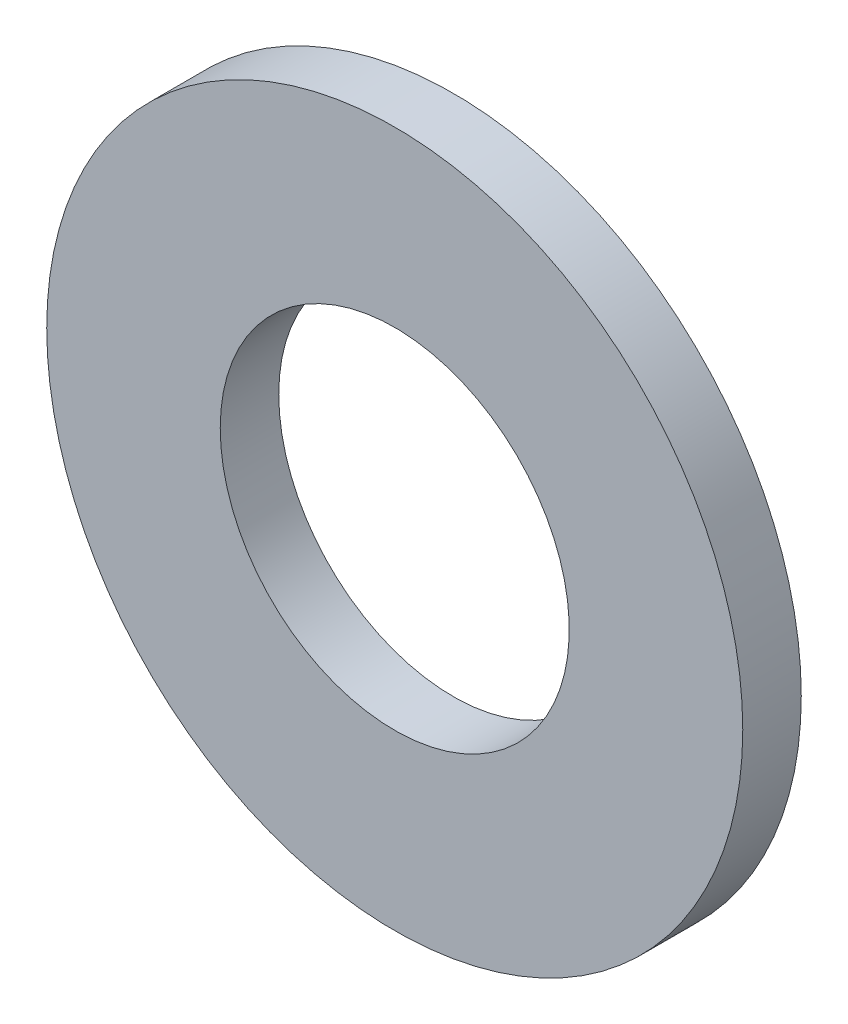
ISO-10303-21;
HEADER;
FILE_DESCRIPTION(('STEP AP214'),'2;1');
FILE_NAME('part.step','',(''),(''),'','','');
FILE_SCHEMA(('AUTOMOTIVE_DESIGN { 1 0 10303 214 1 1 1 1 }'));
ENDSEC;
DATA;
#1=APPLICATION_CONTEXT('core data for automotive mechanical design processes');
#2=APPLICATION_PROTOCOL_DEFINITION('international standard','automotive_design',2000,#1);
#3=PRODUCT_CONTEXT('',#1,'mechanical');
#4=PRODUCT('Part','Part','',(#3));
#5=PRODUCT_RELATED_PRODUCT_CATEGORY('part','',(#4));
#6=PRODUCT_DEFINITION_FORMATION('','',#4);
#7=PRODUCT_DEFINITION_CONTEXT('part definition',#1,'design');
#8=PRODUCT_DEFINITION('design','',#6,#7);
#9=PRODUCT_DEFINITION_SHAPE('','',#8);
#10=(LENGTH_UNIT() NAMED_UNIT(*) SI_UNIT(.MILLI.,.METRE.));
#11=(NAMED_UNIT(*) PLANE_ANGLE_UNIT() SI_UNIT($,.RADIAN.));
#12=(NAMED_UNIT(*) SI_UNIT($,.STERADIAN.) SOLID_ANGLE_UNIT());
#13=UNCERTAINTY_MEASURE_WITH_UNIT(LENGTH_MEASURE(1.E-05),#10,'distance_accuracy_value','');
#14=(GEOMETRIC_REPRESENTATION_CONTEXT(3) GLOBAL_UNCERTAINTY_ASSIGNED_CONTEXT((#13)) GLOBAL_UNIT_ASSIGNED_CONTEXT((#10,
#11,#12)) REPRESENTATION_CONTEXT('',''));
#15=CARTESIAN_POINT('',(0.,0.,0.));
#16=DIRECTION('',(0.,0.,1.));
#17=DIRECTION('',(1.,0.,0.));
#18=AXIS2_PLACEMENT_3D('',#15,#16,#17);
#19=CARTESIAN_POINT('',(0.,0.,0.));
#20=DIRECTION('',(0.,0.,-1.));
#21=DIRECTION('',(-1.,0.,0.));
#22=AXIS2_PLACEMENT_3D('',#19,#20,#21);
#23=PLANE('',#22);
#24=CARTESIAN_POINT('',(0.,0.,0.));
#25=DIRECTION('',(0.,0.,-1.));
#26=DIRECTION('',(-1.,0.,0.));
#27=AXIS2_PLACEMENT_3D('',#24,#25,#26);
#28=CIRCLE('',#27,8.763);
#29=CARTESIAN_POINT('',(-8.763,0.,0.));
#30=VERTEX_POINT('',#29);
#31=EDGE_CURVE('E27',#30,#30,#28,.F.);
#32=ORIENTED_EDGE('',*,*,#31,.F.);
#33=EDGE_LOOP('',(#32));
#34=FACE_BOUND('',#33,.T.);
#35=CARTESIAN_POINT('',(0.,0.,0.));
#36=DIRECTION('',(0.,0.,-1.));
#37=DIRECTION('',(-1.,0.,0.));
#38=AXIS2_PLACEMENT_3D('',#35,#36,#37);
#39=CIRCLE('',#38,4.3942);
#40=CARTESIAN_POINT('',(-4.3942,0.,0.));
#41=VERTEX_POINT('',#40);
#42=EDGE_CURVE('E18',#41,#41,#39,.F.);
#43=ORIENTED_EDGE('',*,*,#42,.T.);
#44=EDGE_LOOP('',(#43));
#45=FACE_BOUND('',#44,.T.);
#46=ADVANCED_FACE('F15',(#34,#45),#23,.T.);
#47=CARTESIAN_POINT('',(0.,0.,1.4732));
#48=DIRECTION('',(0.,0.,-1.));
#49=DIRECTION('',(-1.,0.,0.));
#50=AXIS2_PLACEMENT_3D('',#47,#48,#49);
#51=CYLINDRICAL_SURFACE('',#50,4.3942);
#52=CARTESIAN_POINT('',(0.,0.,1.4732));
#53=DIRECTION('',(0.,0.,-1.));
#54=DIRECTION('',(-1.,0.,0.));
#55=AXIS2_PLACEMENT_3D('',#52,#53,#54);
#56=CIRCLE('',#55,4.3942);
#57=CARTESIAN_POINT('',(-4.3942,0.,1.4732));
#58=VERTEX_POINT('',#57);
#59=EDGE_CURVE('E22',#58,#58,#56,.F.);
#60=ORIENTED_EDGE('',*,*,#59,.T.);
#61=EDGE_LOOP('',(#60));
#62=FACE_BOUND('',#61,.T.);
#63=ORIENTED_EDGE('',*,*,#42,.F.);
#64=EDGE_LOOP('',(#63));
#65=FACE_BOUND('',#64,.T.);
#66=ADVANCED_FACE('F36',(#62,#65),#51,.F.);
#67=CARTESIAN_POINT('',(0.,0.,1.4732));
#68=DIRECTION('',(0.,0.,-1.));
#69=DIRECTION('',(-1.,0.,0.));
#70=AXIS2_PLACEMENT_3D('',#67,#68,#69);
#71=CYLINDRICAL_SURFACE('',#70,8.763);
#72=ORIENTED_EDGE('',*,*,#31,.T.);
#73=EDGE_LOOP('',(#72));
#74=FACE_BOUND('',#73,.T.);
#75=CARTESIAN_POINT('',(0.,0.,1.4732));
#76=DIRECTION('',(0.,0.,-1.));
#77=DIRECTION('',(-1.,0.,0.));
#78=AXIS2_PLACEMENT_3D('',#75,#76,#77);
#79=CIRCLE('',#78,8.763);
#80=CARTESIAN_POINT('',(-8.763,0.,1.4732));
#81=VERTEX_POINT('',#80);
#82=EDGE_CURVE('E10',#81,#81,#79,.T.);
#83=ORIENTED_EDGE('',*,*,#82,.T.);
#84=EDGE_LOOP('',(#83));
#85=FACE_BOUND('',#84,.T.);
#86=ADVANCED_FACE('F38',(#74,#85),#71,.T.);
#87=CARTESIAN_POINT('',(0.,0.,1.4732));
#88=DIRECTION('',(0.,0.,-1.));
#89=DIRECTION('',(-1.,0.,0.));
#90=AXIS2_PLACEMENT_3D('',#87,#88,#89);
#91=PLANE('',#90);
#92=ORIENTED_EDGE('',*,*,#82,.F.);
#93=EDGE_LOOP('',(#92));
#94=FACE_BOUND('',#93,.T.);
#95=ORIENTED_EDGE('',*,*,#59,.F.);
#96=EDGE_LOOP('',(#95));
#97=FACE_BOUND('',#96,.T.);
#98=ADVANCED_FACE('F45',(#94,#97),#91,.F.);
#99=CLOSED_SHELL('',(#46,#66,#86,#98));
#100=MANIFOLD_SOLID_BREP('B1',#99);
#101=ADVANCED_BREP_SHAPE_REPRESENTATION('',(#18,#100),#14);
#102=SHAPE_DEFINITION_REPRESENTATION(#9,#101);
ENDSEC;
END-ISO-10303-21;
